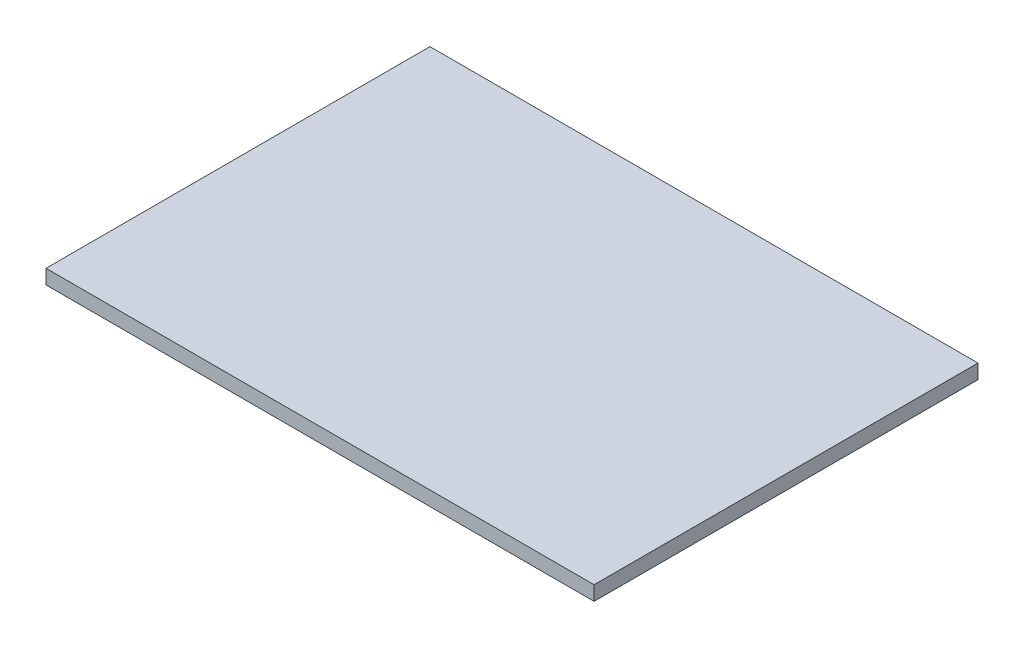
ISO-10303-21;
HEADER;
FILE_DESCRIPTION(('STEP AP214'),'2;1');
FILE_NAME('part.step','',(''),(''),'','','');
FILE_SCHEMA(('AUTOMOTIVE_DESIGN { 1 0 10303 214 1 1 1 1 }'));
ENDSEC;
DATA;
#1=APPLICATION_CONTEXT('core data for automotive mechanical design processes');
#2=APPLICATION_PROTOCOL_DEFINITION('international standard','automotive_design',2000,#1);
#3=PRODUCT_CONTEXT('',#1,'mechanical');
#4=PRODUCT('Part','Part','',(#3));
#5=PRODUCT_RELATED_PRODUCT_CATEGORY('part','',(#4));
#6=PRODUCT_DEFINITION_FORMATION('','',#4);
#7=PRODUCT_DEFINITION_CONTEXT('part definition',#1,'design');
#8=PRODUCT_DEFINITION('design','',#6,#7);
#9=PRODUCT_DEFINITION_SHAPE('','',#8);
#10=(LENGTH_UNIT() NAMED_UNIT(*) SI_UNIT(.MILLI.,.METRE.));
#11=(NAMED_UNIT(*) PLANE_ANGLE_UNIT() SI_UNIT($,.RADIAN.));
#12=(NAMED_UNIT(*) SI_UNIT($,.STERADIAN.) SOLID_ANGLE_UNIT());
#13=UNCERTAINTY_MEASURE_WITH_UNIT(LENGTH_MEASURE(1.E-05),#10,'distance_accuracy_value','');
#14=(GEOMETRIC_REPRESENTATION_CONTEXT(3) GLOBAL_UNCERTAINTY_ASSIGNED_CONTEXT((#13)) GLOBAL_UNIT_ASSIGNED_CONTEXT((#10,
#11,#12)) REPRESENTATION_CONTEXT('',''));
#15=CARTESIAN_POINT('',(0.,0.,0.));
#16=DIRECTION('',(0.,0.,1.));
#17=DIRECTION('',(1.,0.,0.));
#18=AXIS2_PLACEMENT_3D('',#15,#16,#17);
#19=CARTESIAN_POINT('',(0.,3.,79.858632829671));
#20=DIRECTION('',(1.,0.,0.));
#21=DIRECTION('',(0.,0.,-1.));
#22=AXIS2_PLACEMENT_3D('',#19,#20,#21);
#23=PLANE('',#22);
#24=DIRECTION('',(0.,0.,1.));
#25=VECTOR('',#24,1.);
#26=CARTESIAN_POINT('',(0.,0.,79.858632829671));
#27=LINE('',#26,#25);
#28=CARTESIAN_POINT('',(0.,0.,0.));
#29=VERTEX_POINT('',#28);
#30=CARTESIAN_POINT('',(0.,0.,79.858632829671));
#31=VERTEX_POINT('',#30);
#32=EDGE_CURVE('E101',#29,#31,#27,.T.);
#33=ORIENTED_EDGE('',*,*,#32,.T.);
#34=DIRECTION('',(0.,-1.,0.));
#35=VECTOR('',#34,1.);
#36=CARTESIAN_POINT('',(0.,3.,79.858632829671));
#37=LINE('',#36,#35);
#38=CARTESIAN_POINT('',(0.,3.,79.858632829671));
#39=VERTEX_POINT('',#38);
#40=EDGE_CURVE('E11',#39,#31,#37,.T.);
#41=ORIENTED_EDGE('',*,*,#40,.F.);
#42=DIRECTION('',(0.,0.,1.));
#43=VECTOR('',#42,1.);
#44=CARTESIAN_POINT('',(0.,3.,79.858632829671));
#45=LINE('',#44,#43);
#46=CARTESIAN_POINT('',(0.,3.,0.));
#47=VERTEX_POINT('',#46);
#48=EDGE_CURVE('E89',#47,#39,#45,.T.);
#49=ORIENTED_EDGE('',*,*,#48,.F.);
#50=DIRECTION('',(0.,-1.,0.));
#51=VECTOR('',#50,1.);
#52=CARTESIAN_POINT('',(0.,3.,0.));
#53=LINE('',#52,#51);
#54=EDGE_CURVE('E97',#47,#29,#53,.T.);
#55=ORIENTED_EDGE('',*,*,#54,.T.);
#56=EDGE_LOOP('',(#33,#41,#49,#55));
#57=FACE_BOUND('',#56,.T.);
#58=ADVANCED_FACE('F38',(#57),#23,.F.);
#59=CARTESIAN_POINT('',(114.,3.,79.858632829671));
#60=DIRECTION('',(0.,0.,-1.));
#61=DIRECTION('',(-1.,0.,0.));
#62=AXIS2_PLACEMENT_3D('',#59,#60,#61);
#63=PLANE('',#62);
#64=DIRECTION('',(1.,0.,0.));
#65=VECTOR('',#64,1.);
#66=CARTESIAN_POINT('',(114.,0.,79.858632829671));
#67=LINE('',#66,#65);
#68=CARTESIAN_POINT('',(114.,0.,79.858632829671));
#69=VERTEX_POINT('',#68);
#70=EDGE_CURVE('E93',#31,#69,#67,.T.);
#71=ORIENTED_EDGE('',*,*,#70,.T.);
#72=DIRECTION('',(0.,-1.,0.));
#73=VECTOR('',#72,1.);
#74=CARTESIAN_POINT('',(114.,3.,79.858632829671));
#75=LINE('',#74,#73);
#76=CARTESIAN_POINT('',(114.,3.,79.858632829671));
#77=VERTEX_POINT('',#76);
#78=EDGE_CURVE('E46',#77,#69,#75,.T.);
#79=ORIENTED_EDGE('',*,*,#78,.F.);
#80=DIRECTION('',(1.,0.,0.));
#81=VECTOR('',#80,1.);
#82=CARTESIAN_POINT('',(114.,3.,79.858632829671));
#83=LINE('',#82,#81);
#84=EDGE_CURVE('E84',#39,#77,#83,.T.);
#85=ORIENTED_EDGE('',*,*,#84,.F.);
#86=ORIENTED_EDGE('',*,*,#40,.T.);
#87=EDGE_LOOP('',(#71,#79,#85,#86));
#88=FACE_BOUND('',#87,.T.);
#89=ADVANCED_FACE('F92',(#88),#63,.F.);
#90=CARTESIAN_POINT('',(114.,3.,0.));
#91=DIRECTION('',(-1.,0.,0.));
#92=DIRECTION('',(0.,0.,1.));
#93=AXIS2_PLACEMENT_3D('',#90,#91,#92);
#94=PLANE('',#93);
#95=DIRECTION('',(0.,0.,-1.));
#96=VECTOR('',#95,1.);
#97=CARTESIAN_POINT('',(114.,0.,0.));
#98=LINE('',#97,#96);
#99=CARTESIAN_POINT('',(114.,0.,0.));
#100=VERTEX_POINT('',#99);
#101=EDGE_CURVE('E71',#69,#100,#98,.T.);
#102=ORIENTED_EDGE('',*,*,#101,.T.);
#103=DIRECTION('',(0.,-1.,0.));
#104=VECTOR('',#103,1.);
#105=CARTESIAN_POINT('',(114.,3.,0.));
#106=LINE('',#105,#104);
#107=CARTESIAN_POINT('',(114.,3.,0.));
#108=VERTEX_POINT('',#107);
#109=EDGE_CURVE('E94',#108,#100,#106,.T.);
#110=ORIENTED_EDGE('',*,*,#109,.F.);
#111=DIRECTION('',(0.,0.,-1.));
#112=VECTOR('',#111,1.);
#113=CARTESIAN_POINT('',(114.,3.,0.));
#114=LINE('',#113,#112);
#115=EDGE_CURVE('E87',#77,#108,#114,.T.);
#116=ORIENTED_EDGE('',*,*,#115,.F.);
#117=ORIENTED_EDGE('',*,*,#78,.T.);
#118=EDGE_LOOP('',(#102,#110,#116,#117));
#119=FACE_BOUND('',#118,.T.);
#120=ADVANCED_FACE('F95',(#119),#94,.F.);
#121=CARTESIAN_POINT('',(0.,3.,0.));
#122=DIRECTION('',(0.,0.,1.));
#123=DIRECTION('',(1.,0.,0.));
#124=AXIS2_PLACEMENT_3D('',#121,#122,#123);
#125=PLANE('',#124);
#126=DIRECTION('',(-1.,0.,0.));
#127=VECTOR('',#126,1.);
#128=CARTESIAN_POINT('',(0.,0.,0.));
#129=LINE('',#128,#127);
#130=EDGE_CURVE('E77',#100,#29,#129,.T.);
#131=ORIENTED_EDGE('',*,*,#130,.T.);
#132=ORIENTED_EDGE('',*,*,#54,.F.);
#133=DIRECTION('',(-1.,0.,0.));
#134=VECTOR('',#133,1.);
#135=CARTESIAN_POINT('',(0.,3.,0.));
#136=LINE('',#135,#134);
#137=EDGE_CURVE('E54',#108,#47,#136,.T.);
#138=ORIENTED_EDGE('',*,*,#137,.F.);
#139=ORIENTED_EDGE('',*,*,#109,.T.);
#140=EDGE_LOOP('',(#131,#132,#138,#139));
#141=FACE_BOUND('',#140,.T.);
#142=ADVANCED_FACE('F108',(#141),#125,.F.);
#143=CARTESIAN_POINT('',(0.,3.,0.));
#144=DIRECTION('',(0.,-1.,0.));
#145=DIRECTION('',(0.,0.,-1.));
#146=AXIS2_PLACEMENT_3D('',#143,#144,#145);
#147=PLANE('',#146);
#148=ORIENTED_EDGE('',*,*,#48,.T.);
#149=ORIENTED_EDGE('',*,*,#84,.T.);
#150=ORIENTED_EDGE('',*,*,#115,.T.);
#151=ORIENTED_EDGE('',*,*,#137,.T.);
#152=EDGE_LOOP('',(#148,#149,#150,#151));
#153=FACE_BOUND('',#152,.T.);
#154=ADVANCED_FACE('F85',(#153),#147,.F.);
#155=CARTESIAN_POINT('',(0.,0.,0.));
#156=DIRECTION('',(0.,-1.,0.));
#157=DIRECTION('',(0.,0.,-1.));
#158=AXIS2_PLACEMENT_3D('',#155,#156,#157);
#159=PLANE('',#158);
#160=ORIENTED_EDGE('',*,*,#32,.F.);
#161=ORIENTED_EDGE('',*,*,#130,.F.);
#162=ORIENTED_EDGE('',*,*,#101,.F.);
#163=ORIENTED_EDGE('',*,*,#70,.F.);
#164=EDGE_LOOP('',(#160,#161,#162,#163));
#165=FACE_BOUND('',#164,.T.);
#166=ADVANCED_FACE('F111',(#165),#159,.T.);
#167=CLOSED_SHELL('',(#58,#89,#120,#142,#154,#166));
#168=MANIFOLD_SOLID_BREP('B2',#167);
#169=ADVANCED_BREP_SHAPE_REPRESENTATION('',(#18,#168),#14);
#170=SHAPE_DEFINITION_REPRESENTATION(#9,#169);
ENDSEC;
END-ISO-10303-21;
